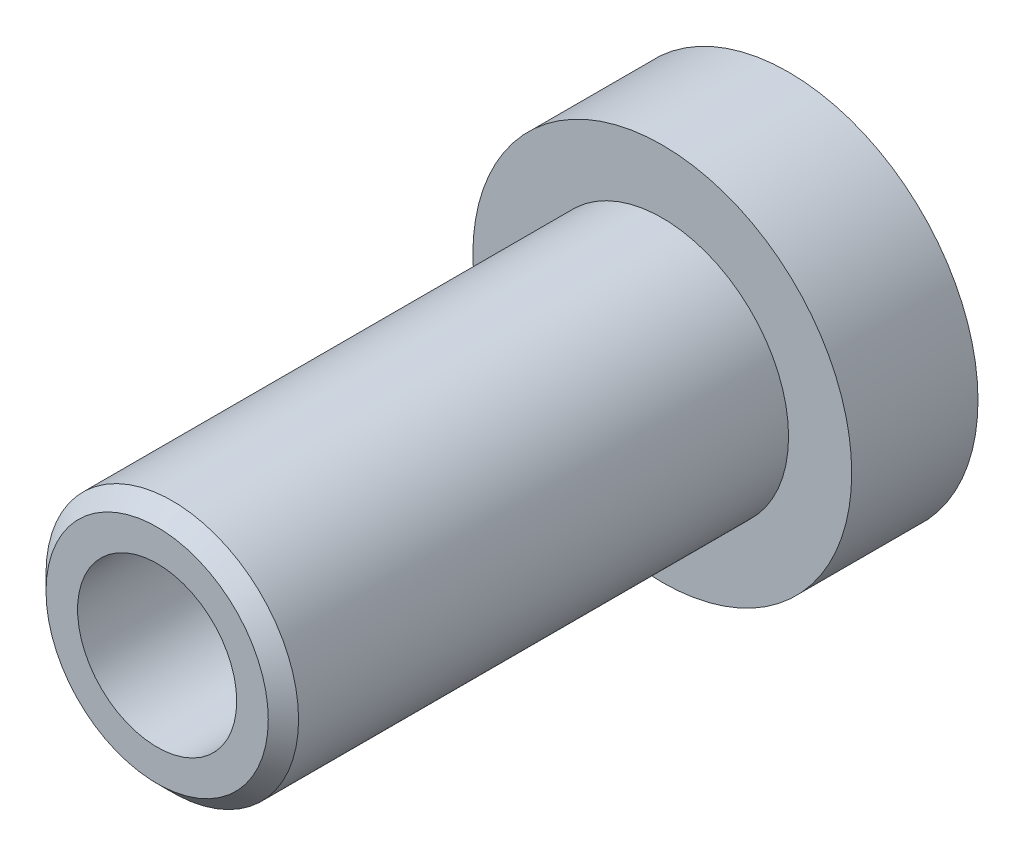
ISO-10303-21;
HEADER;
FILE_DESCRIPTION(('STEP AP214'),'2;1');
FILE_NAME('part.step','',(''),(''),'','','');
FILE_SCHEMA(('AUTOMOTIVE_DESIGN { 1 0 10303 214 1 1 1 1 }'));
ENDSEC;
DATA;
#1=APPLICATION_CONTEXT('core data for automotive mechanical design processes');
#2=APPLICATION_PROTOCOL_DEFINITION('international standard','automotive_design',2000,#1);
#3=PRODUCT_CONTEXT('',#1,'mechanical');
#4=PRODUCT('Part','Part','',(#3));
#5=PRODUCT_RELATED_PRODUCT_CATEGORY('part','',(#4));
#6=PRODUCT_DEFINITION_FORMATION('','',#4);
#7=PRODUCT_DEFINITION_CONTEXT('part definition',#1,'design');
#8=PRODUCT_DEFINITION('design','',#6,#7);
#9=PRODUCT_DEFINITION_SHAPE('','',#8);
#10=(LENGTH_UNIT() NAMED_UNIT(*) SI_UNIT(.MILLI.,.METRE.));
#11=(NAMED_UNIT(*) PLANE_ANGLE_UNIT() SI_UNIT($,.RADIAN.));
#12=(NAMED_UNIT(*) SI_UNIT($,.STERADIAN.) SOLID_ANGLE_UNIT());
#13=UNCERTAINTY_MEASURE_WITH_UNIT(LENGTH_MEASURE(1.E-05),#10,'distance_accuracy_value','');
#14=(GEOMETRIC_REPRESENTATION_CONTEXT(3) GLOBAL_UNCERTAINTY_ASSIGNED_CONTEXT((#13)) GLOBAL_UNIT_ASSIGNED_CONTEXT((#10,
#11,#12)) REPRESENTATION_CONTEXT('',''));
#15=CARTESIAN_POINT('',(0.,0.,0.));
#16=DIRECTION('',(0.,0.,1.));
#17=DIRECTION('',(1.,0.,0.));
#18=AXIS2_PLACEMENT_3D('',#15,#16,#17);
#19=CARTESIAN_POINT('',(0.,0.,-73.759969248241));
#20=DIRECTION('',(0.,0.,1.));
#21=DIRECTION('',(1.,0.,0.));
#22=AXIS2_PLACEMENT_3D('',#19,#20,#21);
#23=PLANE('',#22);
#24=CARTESIAN_POINT('',(0.,0.,-73.759969248241));
#25=DIRECTION('',(0.,0.,1.));
#26=DIRECTION('',(1.,0.,0.));
#27=AXIS2_PLACEMENT_3D('',#24,#25,#26);
#28=CIRCLE('',#27,31.5);
#29=CARTESIAN_POINT('',(31.5,0.,-73.759969248241));
#30=VERTEX_POINT('',#29);
#31=EDGE_CURVE('E61',#30,#30,#28,.T.);
#32=ORIENTED_EDGE('',*,*,#31,.T.);
#33=EDGE_LOOP('',(#32));
#34=FACE_BOUND('',#33,.T.);
#35=CARTESIAN_POINT('',(0.,0.,-73.759969248241));
#36=DIRECTION('',(0.,0.,-1.));
#37=DIRECTION('',(-1.,0.,0.));
#38=AXIS2_PLACEMENT_3D('',#35,#36,#37);
#39=CIRCLE('',#38,75.);
#40=CARTESIAN_POINT('',(-75.,0.,-73.759969248241));
#41=VERTEX_POINT('',#40);
#42=EDGE_CURVE('E10',#41,#41,#39,.T.);
#43=ORIENTED_EDGE('',*,*,#42,.T.);
#44=EDGE_LOOP('',(#43));
#45=FACE_BOUND('',#44,.T.);
#46=ADVANCED_FACE('F39',(#34,#45),#23,.F.);
#47=CARTESIAN_POINT('',(0.,0.,-73.759969248241));
#48=DIRECTION('',(0.,0.,-1.));
#49=DIRECTION('',(-1.,0.,0.));
#50=AXIS2_PLACEMENT_3D('',#47,#48,#49);
#51=CYLINDRICAL_SURFACE('',#50,75.);
#52=ORIENTED_EDGE('',*,*,#42,.F.);
#53=EDGE_LOOP('',(#52));
#54=FACE_BOUND('',#53,.T.);
#55=CARTESIAN_POINT('',(0.,0.,-23.759969248241));
#56=DIRECTION('',(0.,0.,-1.));
#57=DIRECTION('',(-1.,0.,0.));
#58=AXIS2_PLACEMENT_3D('',#55,#56,#57);
#59=CIRCLE('',#58,75.);
#60=CARTESIAN_POINT('',(-75.,0.,-23.759969248241));
#61=VERTEX_POINT('',#60);
#62=EDGE_CURVE('E45',#61,#61,#59,.T.);
#63=ORIENTED_EDGE('',*,*,#62,.T.);
#64=EDGE_LOOP('',(#63));
#65=FACE_BOUND('',#64,.T.);
#66=ADVANCED_FACE('F94',(#54,#65),#51,.T.);
#67=CARTESIAN_POINT('',(75.,0.,-23.759969248241));
#68=DIRECTION('',(0.,0.,-1.));
#69=DIRECTION('',(-1.,0.,0.));
#70=AXIS2_PLACEMENT_3D('',#67,#68,#69);
#71=PLANE('',#70);
#72=ORIENTED_EDGE('',*,*,#62,.F.);
#73=EDGE_LOOP('',(#72));
#74=FACE_BOUND('',#73,.T.);
#75=CARTESIAN_POINT('',(0.,0.,-23.759969248241));
#76=DIRECTION('',(0.,0.,-1.));
#77=DIRECTION('',(-1.,0.,0.));
#78=AXIS2_PLACEMENT_3D('',#75,#76,#77);
#79=CIRCLE('',#78,50.);
#80=CARTESIAN_POINT('',(-50.,0.,-23.759969248241));
#81=VERTEX_POINT('',#80);
#82=EDGE_CURVE('E49',#81,#81,#79,.T.);
#83=ORIENTED_EDGE('',*,*,#82,.T.);
#84=EDGE_LOOP('',(#83));
#85=FACE_BOUND('',#84,.T.);
#86=ADVANCED_FACE('F89',(#74,#85),#71,.F.);
#87=CARTESIAN_POINT('',(0.,0.,-73.759969248241));
#88=DIRECTION('',(0.,0.,-1.));
#89=DIRECTION('',(-1.,0.,0.));
#90=AXIS2_PLACEMENT_3D('',#87,#88,#89);
#91=CYLINDRICAL_SURFACE('',#90,50.);
#92=ORIENTED_EDGE('',*,*,#82,.F.);
#93=EDGE_LOOP('',(#92));
#94=FACE_BOUND('',#93,.T.);
#95=CARTESIAN_POINT('',(0.,0.,170.240030751759));
#96=DIRECTION('',(0.,0.,-1.));
#97=DIRECTION('',(-1.,0.,0.));
#98=AXIS2_PLACEMENT_3D('',#95,#96,#97);
#99=CIRCLE('',#98,50.);
#100=CARTESIAN_POINT('',(-50.,0.,170.240030751759));
#101=VERTEX_POINT('',#100);
#102=EDGE_CURVE('E53',#101,#101,#99,.T.);
#103=ORIENTED_EDGE('',*,*,#102,.T.);
#104=EDGE_LOOP('',(#103));
#105=FACE_BOUND('',#104,.T.);
#106=ADVANCED_FACE('F83',(#94,#105),#91,.T.);
#107=CARTESIAN_POINT('',(0.,0.,176.240030751759));
#108=DIRECTION('',(0.,0.,-1.));
#109=DIRECTION('',(-1.,0.,0.));
#110=AXIS2_PLACEMENT_3D('',#107,#108,#109);
#111=CONICAL_SURFACE('',#110,44.,0.785398163397448);
#112=ORIENTED_EDGE('',*,*,#102,.F.);
#113=EDGE_LOOP('',(#112));
#114=FACE_BOUND('',#113,.T.);
#115=CARTESIAN_POINT('',(0.,0.,176.240030751759));
#116=DIRECTION('',(0.,0.,-1.));
#117=DIRECTION('',(-1.,0.,0.));
#118=AXIS2_PLACEMENT_3D('',#115,#116,#117);
#119=CIRCLE('',#118,44.);
#120=CARTESIAN_POINT('',(-44.,0.,176.240030751759));
#121=VERTEX_POINT('',#120);
#122=EDGE_CURVE('E58',#121,#121,#119,.T.);
#123=ORIENTED_EDGE('',*,*,#122,.T.);
#124=EDGE_LOOP('',(#123));
#125=FACE_BOUND('',#124,.T.);
#126=ADVANCED_FACE('F78',(#114,#125),#111,.T.);
#127=CARTESIAN_POINT('',(44.,0.,176.240030751759));
#128=DIRECTION('',(0.,0.,-1.));
#129=DIRECTION('',(-1.,0.,0.));
#130=AXIS2_PLACEMENT_3D('',#127,#128,#129);
#131=PLANE('',#130);
#132=CARTESIAN_POINT('',(0.,0.,176.240030751759));
#133=DIRECTION('',(0.,0.,1.));
#134=DIRECTION('',(1.,0.,0.));
#135=AXIS2_PLACEMENT_3D('',#132,#133,#134);
#136=CIRCLE('',#135,31.5);
#137=CARTESIAN_POINT('',(31.5,0.,176.240030751759));
#138=VERTEX_POINT('',#137);
#139=EDGE_CURVE('E62',#138,#138,#136,.T.);
#140=ORIENTED_EDGE('',*,*,#139,.F.);
#141=EDGE_LOOP('',(#140));
#142=FACE_BOUND('',#141,.T.);
#143=ORIENTED_EDGE('',*,*,#122,.F.);
#144=EDGE_LOOP('',(#143));
#145=FACE_BOUND('',#144,.T.);
#146=ADVANCED_FACE('F72',(#142,#145),#131,.F.);
#147=CARTESIAN_POINT('',(0.,0.,-73.759969248241));
#148=DIRECTION('',(0.,0.,1.));
#149=DIRECTION('',(1.,0.,0.));
#150=AXIS2_PLACEMENT_3D('',#147,#148,#149);
#151=CYLINDRICAL_SURFACE('',#150,31.5);
#152=ORIENTED_EDGE('',*,*,#31,.F.);
#153=EDGE_LOOP('',(#152));
#154=FACE_BOUND('',#153,.T.);
#155=ORIENTED_EDGE('',*,*,#139,.T.);
#156=EDGE_LOOP('',(#155));
#157=FACE_BOUND('',#156,.T.);
#158=ADVANCED_FACE('F69',(#154,#157),#151,.F.);
#159=CLOSED_SHELL('',(#46,#66,#86,#106,#126,#146,#158));
#160=MANIFOLD_SOLID_BREP('B2',#159);
#161=ADVANCED_BREP_SHAPE_REPRESENTATION('',(#18,#160),#14);
#162=SHAPE_DEFINITION_REPRESENTATION(#9,#161);
ENDSEC;
END-ISO-10303-21;
